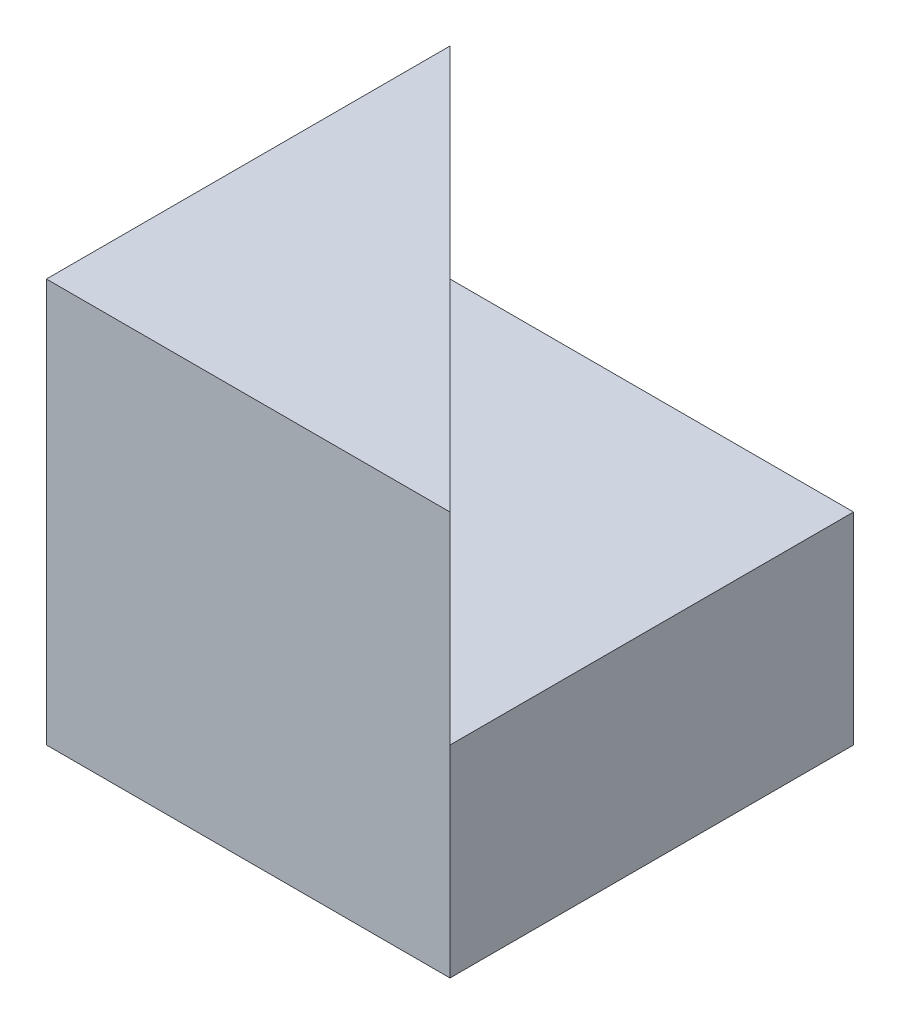
ISO-10303-21;
HEADER;
FILE_DESCRIPTION(('STEP AP214'),'2;1');
FILE_NAME('part.step','',(''),(''),'','','');
FILE_SCHEMA(('AUTOMOTIVE_DESIGN { 1 0 10303 214 1 1 1 1 }'));
ENDSEC;
DATA;
#1=APPLICATION_CONTEXT('core data for automotive mechanical design processes');
#2=APPLICATION_PROTOCOL_DEFINITION('international standard','automotive_design',2000,#1);
#3=PRODUCT_CONTEXT('',#1,'mechanical');
#4=PRODUCT('Part','Part','',(#3));
#5=PRODUCT_RELATED_PRODUCT_CATEGORY('part','',(#4));
#6=PRODUCT_DEFINITION_FORMATION('','',#4);
#7=PRODUCT_DEFINITION_CONTEXT('part definition',#1,'design');
#8=PRODUCT_DEFINITION('design','',#6,#7);
#9=PRODUCT_DEFINITION_SHAPE('','',#8);
#10=(LENGTH_UNIT() NAMED_UNIT(*) SI_UNIT(.MILLI.,.METRE.));
#11=(NAMED_UNIT(*) PLANE_ANGLE_UNIT() SI_UNIT($,.RADIAN.));
#12=(NAMED_UNIT(*) SI_UNIT($,.STERADIAN.) SOLID_ANGLE_UNIT());
#13=UNCERTAINTY_MEASURE_WITH_UNIT(LENGTH_MEASURE(1.E-05),#10,'distance_accuracy_value','');
#14=(GEOMETRIC_REPRESENTATION_CONTEXT(3) GLOBAL_UNCERTAINTY_ASSIGNED_CONTEXT((#13)) GLOBAL_UNIT_ASSIGNED_CONTEXT((#10,
#11,#12)) REPRESENTATION_CONTEXT('',''));
#15=CARTESIAN_POINT('',(0.,0.,0.));
#16=DIRECTION('',(0.,0.,1.));
#17=DIRECTION('',(1.,0.,0.));
#18=AXIS2_PLACEMENT_3D('',#15,#16,#17);
#19=CARTESIAN_POINT('',(0.,0.,40.));
#20=DIRECTION('',(1.,0.,0.));
#21=DIRECTION('',(0.,0.,-1.));
#22=AXIS2_PLACEMENT_3D('',#19,#20,#21);
#23=PLANE('',#22);
#24=DIRECTION('',(0.,-1.,0.));
#25=VECTOR('',#24,1.);
#26=CARTESIAN_POINT('',(0.,0.,0.));
#27=LINE('',#26,#25);
#28=CARTESIAN_POINT('',(0.,40.,0.));
#29=VERTEX_POINT('',#28);
#30=CARTESIAN_POINT('',(0.,20.,0.));
#31=VERTEX_POINT('',#30);
#32=EDGE_CURVE('E90',#29,#31,#27,.T.);
#33=ORIENTED_EDGE('',*,*,#32,.T.);
#34=CARTESIAN_POINT('',(0.,0.,0.));
#35=VERTEX_POINT('',#34);
#36=EDGE_CURVE('E102',#31,#35,#27,.T.);
#37=ORIENTED_EDGE('',*,*,#36,.T.);
#38=DIRECTION('',(0.,0.,-1.));
#39=VECTOR('',#38,1.);
#40=CARTESIAN_POINT('',(0.,0.,40.));
#41=LINE('',#40,#39);
#42=CARTESIAN_POINT('',(0.,0.,40.));
#43=VERTEX_POINT('',#42);
#44=EDGE_CURVE('E11',#43,#35,#41,.T.);
#45=ORIENTED_EDGE('',*,*,#44,.F.);
#46=DIRECTION('',(0.,-1.,0.));
#47=VECTOR('',#46,1.);
#48=CARTESIAN_POINT('',(0.,0.,40.));
#49=LINE('',#48,#47);
#50=CARTESIAN_POINT('',(0.,40.,40.));
#51=VERTEX_POINT('',#50);
#52=EDGE_CURVE('E116',#51,#43,#49,.T.);
#53=ORIENTED_EDGE('',*,*,#52,.F.);
#54=DIRECTION('',(0.,0.,-1.));
#55=VECTOR('',#54,1.);
#56=CARTESIAN_POINT('',(0.,40.,40.));
#57=LINE('',#56,#55);
#58=EDGE_CURVE('E109',#51,#29,#57,.T.);
#59=ORIENTED_EDGE('',*,*,#58,.T.);
#60=EDGE_LOOP('',(#33,#37,#45,#53,#59));
#61=FACE_BOUND('',#60,.T.);
#62=ADVANCED_FACE('F33',(#61),#23,.F.);
#63=CARTESIAN_POINT('',(0.,0.,40.));
#64=DIRECTION('',(0.,1.,0.));
#65=DIRECTION('',(0.,0.,1.));
#66=AXIS2_PLACEMENT_3D('',#63,#64,#65);
#67=PLANE('',#66);
#68=DIRECTION('',(1.,0.,0.));
#69=VECTOR('',#68,1.);
#70=CARTESIAN_POINT('',(0.,0.,0.));
#71=LINE('',#70,#69);
#72=CARTESIAN_POINT('',(40.,0.,0.));
#73=VERTEX_POINT('',#72);
#74=EDGE_CURVE('E71',#35,#73,#71,.T.);
#75=ORIENTED_EDGE('',*,*,#74,.T.);
#76=DIRECTION('',(0.,0.,-1.));
#77=VECTOR('',#76,1.);
#78=CARTESIAN_POINT('',(40.,0.,40.));
#79=LINE('',#78,#77);
#80=CARTESIAN_POINT('',(40.,0.,40.));
#81=VERTEX_POINT('',#80);
#82=EDGE_CURVE('E40',#81,#73,#79,.T.);
#83=ORIENTED_EDGE('',*,*,#82,.F.);
#84=DIRECTION('',(1.,0.,0.));
#85=VECTOR('',#84,1.);
#86=CARTESIAN_POINT('',(0.,0.,40.));
#87=LINE('',#86,#85);
#88=EDGE_CURVE('E74',#43,#81,#87,.T.);
#89=ORIENTED_EDGE('',*,*,#88,.F.);
#90=ORIENTED_EDGE('',*,*,#44,.T.);
#91=EDGE_LOOP('',(#75,#83,#89,#90));
#92=FACE_BOUND('',#91,.T.);
#93=ADVANCED_FACE('F122',(#92),#67,.F.);
#94=CARTESIAN_POINT('',(40.,0.,40.));
#95=DIRECTION('',(-1.,0.,0.));
#96=DIRECTION('',(0.,0.,1.));
#97=AXIS2_PLACEMENT_3D('',#94,#95,#96);
#98=PLANE('',#97);
#99=DIRECTION('',(0.,1.,0.));
#100=VECTOR('',#99,1.);
#101=CARTESIAN_POINT('',(40.,0.,0.));
#102=LINE('',#101,#100);
#103=CARTESIAN_POINT('',(40.,20.,0.));
#104=VERTEX_POINT('',#103);
#105=EDGE_CURVE('E110',#73,#104,#102,.T.);
#106=ORIENTED_EDGE('',*,*,#105,.T.);
#107=DIRECTION('',(0.,0.,-1.));
#108=VECTOR('',#107,1.);
#109=CARTESIAN_POINT('',(40.,20.,40.));
#110=LINE('',#109,#108);
#111=CARTESIAN_POINT('',(40.,20.,40.));
#112=VERTEX_POINT('',#111);
#113=EDGE_CURVE('E47',#112,#104,#110,.T.);
#114=ORIENTED_EDGE('',*,*,#113,.F.);
#115=DIRECTION('',(0.,1.,0.));
#116=VECTOR('',#115,1.);
#117=CARTESIAN_POINT('',(40.,0.,40.));
#118=LINE('',#117,#116);
#119=EDGE_CURVE('E121',#81,#112,#118,.T.);
#120=ORIENTED_EDGE('',*,*,#119,.F.);
#121=ORIENTED_EDGE('',*,*,#82,.T.);
#122=EDGE_LOOP('',(#106,#114,#120,#121));
#123=FACE_BOUND('',#122,.T.);
#124=ADVANCED_FACE('F119',(#123),#98,.F.);
#125=CARTESIAN_POINT('',(0.,40.,40.));
#126=DIRECTION('',(0.,-1.,0.));
#127=DIRECTION('',(0.,0.,-1.));
#128=AXIS2_PLACEMENT_3D('',#125,#126,#127);
#129=PLANE('',#128);
#130=DIRECTION('',(-1.,0.,0.));
#131=VECTOR('',#130,1.);
#132=CARTESIAN_POINT('',(0.,40.,40.));
#133=LINE('',#132,#131);
#134=CARTESIAN_POINT('',(40.,40.,40.));
#135=VERTEX_POINT('',#134);
#136=EDGE_CURVE('E56',#135,#51,#133,.T.);
#137=ORIENTED_EDGE('',*,*,#136,.F.);
#138=DIRECTION('',(0.707106781186548,0.,0.707106781186548));
#139=VECTOR('',#138,1.);
#140=CARTESIAN_POINT('',(0.,40.,0.));
#141=LINE('',#140,#139);
#142=EDGE_CURVE('E100',#29,#135,#141,.T.);
#143=ORIENTED_EDGE('',*,*,#142,.F.);
#144=ORIENTED_EDGE('',*,*,#58,.F.);
#145=EDGE_LOOP('',(#137,#143,#144));
#146=FACE_BOUND('',#145,.T.);
#147=ADVANCED_FACE('F128',(#146),#129,.F.);
#148=CARTESIAN_POINT('',(0.,0.,40.));
#149=DIRECTION('',(0.,0.,-1.));
#150=DIRECTION('',(-1.,0.,0.));
#151=AXIS2_PLACEMENT_3D('',#148,#149,#150);
#152=PLANE('',#151);
#153=ORIENTED_EDGE('',*,*,#52,.T.);
#154=ORIENTED_EDGE('',*,*,#88,.T.);
#155=ORIENTED_EDGE('',*,*,#119,.T.);
#156=DIRECTION('',(0.,1.,0.));
#157=VECTOR('',#156,1.);
#158=CARTESIAN_POINT('',(40.,20.,40.));
#159=LINE('',#158,#157);
#160=EDGE_CURVE('E92',#112,#135,#159,.T.);
#161=ORIENTED_EDGE('',*,*,#160,.T.);
#162=ORIENTED_EDGE('',*,*,#136,.T.);
#163=EDGE_LOOP('',(#153,#154,#155,#161,#162));
#164=FACE_BOUND('',#163,.T.);
#165=ADVANCED_FACE('F133',(#164),#152,.F.);
#166=CARTESIAN_POINT('',(0.,0.,0.));
#167=DIRECTION('',(0.,0.,-1.));
#168=DIRECTION('',(-1.,0.,0.));
#169=AXIS2_PLACEMENT_3D('',#166,#167,#168);
#170=PLANE('',#169);
#171=DIRECTION('',(-1.,0.,0.));
#172=VECTOR('',#171,1.);
#173=CARTESIAN_POINT('',(40.,20.,0.));
#174=LINE('',#173,#172);
#175=EDGE_CURVE('E93',#104,#31,#174,.T.);
#176=ORIENTED_EDGE('',*,*,#175,.F.);
#177=ORIENTED_EDGE('',*,*,#105,.F.);
#178=ORIENTED_EDGE('',*,*,#74,.F.);
#179=ORIENTED_EDGE('',*,*,#36,.F.);
#180=EDGE_LOOP('',(#176,#177,#178,#179));
#181=FACE_BOUND('',#180,.T.);
#182=ADVANCED_FACE('F103',(#181),#170,.T.);
#183=CARTESIAN_POINT('',(0.,20.,0.));
#184=DIRECTION('',(-0.707106781186548,0.,0.707106781186548));
#185=DIRECTION('',(0.707106781186548,0.,0.707106781186548));
#186=AXIS2_PLACEMENT_3D('',#183,#184,#185);
#187=PLANE('',#186);
#188=ORIENTED_EDGE('',*,*,#142,.T.);
#189=ORIENTED_EDGE('',*,*,#160,.F.);
#190=DIRECTION('',(0.707106781186548,0.,0.707106781186548));
#191=VECTOR('',#190,1.);
#192=CARTESIAN_POINT('',(0.,20.,0.));
#193=LINE('',#192,#191);
#194=EDGE_CURVE('E87',#31,#112,#193,.T.);
#195=ORIENTED_EDGE('',*,*,#194,.F.);
#196=ORIENTED_EDGE('',*,*,#32,.F.);
#197=EDGE_LOOP('',(#188,#189,#195,#196));
#198=FACE_BOUND('',#197,.T.);
#199=ADVANCED_FACE('F88',(#198),#187,.F.);
#200=CARTESIAN_POINT('',(0.,20.,0.));
#201=DIRECTION('',(0.,-1.,0.));
#202=DIRECTION('',(0.,0.,-1.));
#203=AXIS2_PLACEMENT_3D('',#200,#201,#202);
#204=PLANE('',#203);
#205=ORIENTED_EDGE('',*,*,#175,.T.);
#206=ORIENTED_EDGE('',*,*,#194,.T.);
#207=ORIENTED_EDGE('',*,*,#113,.T.);
#208=EDGE_LOOP('',(#205,#206,#207));
#209=FACE_BOUND('',#208,.T.);
#210=ADVANCED_FACE('F96',(#209),#204,.F.);
#211=CLOSED_SHELL('',(#62,#93,#124,#147,#165,#182,#199,#210));
#212=MANIFOLD_SOLID_BREP('B2',#211);
#213=ADVANCED_BREP_SHAPE_REPRESENTATION('',(#18,#212),#14);
#214=SHAPE_DEFINITION_REPRESENTATION(#9,#213);
ENDSEC;
END-ISO-10303-21;
